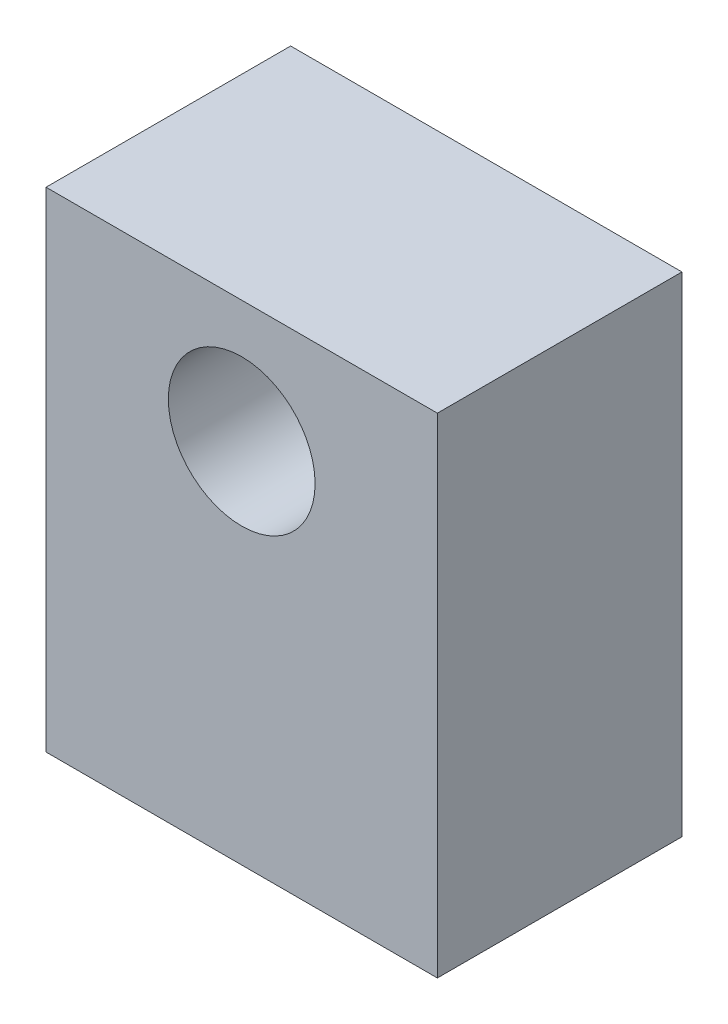
ISO-10303-21;
HEADER;
FILE_DESCRIPTION(('STEP AP214'),'2;1');
FILE_NAME('part.step','',(''),(''),'','','');
FILE_SCHEMA(('AUTOMOTIVE_DESIGN { 1 0 10303 214 1 1 1 1 }'));
ENDSEC;
DATA;
#1=APPLICATION_CONTEXT('core data for automotive mechanical design processes');
#2=APPLICATION_PROTOCOL_DEFINITION('international standard','automotive_design',2000,#1);
#3=PRODUCT_CONTEXT('',#1,'mechanical');
#4=PRODUCT('Part','Part','',(#3));
#5=PRODUCT_RELATED_PRODUCT_CATEGORY('part','',(#4));
#6=PRODUCT_DEFINITION_FORMATION('','',#4);
#7=PRODUCT_DEFINITION_CONTEXT('part definition',#1,'design');
#8=PRODUCT_DEFINITION('design','',#6,#7);
#9=PRODUCT_DEFINITION_SHAPE('','',#8);
#10=(LENGTH_UNIT() NAMED_UNIT(*) SI_UNIT(.MILLI.,.METRE.));
#11=(NAMED_UNIT(*) PLANE_ANGLE_UNIT() SI_UNIT($,.RADIAN.));
#12=(NAMED_UNIT(*) SI_UNIT($,.STERADIAN.) SOLID_ANGLE_UNIT());
#13=UNCERTAINTY_MEASURE_WITH_UNIT(LENGTH_MEASURE(1.E-05),#10,'distance_accuracy_value','');
#14=(GEOMETRIC_REPRESENTATION_CONTEXT(3) GLOBAL_UNCERTAINTY_ASSIGNED_CONTEXT((#13)) GLOBAL_UNIT_ASSIGNED_CONTEXT((#10,
#11,#12)) REPRESENTATION_CONTEXT('',''));
#15=CARTESIAN_POINT('',(0.,0.,0.));
#16=DIRECTION('',(0.,0.,1.));
#17=DIRECTION('',(1.,0.,0.));
#18=AXIS2_PLACEMENT_3D('',#15,#16,#17);
#19=CARTESIAN_POINT('',(0.,0.,5.));
#20=DIRECTION('',(0.,0.,1.));
#21=DIRECTION('',(1.,0.,0.));
#22=AXIS2_PLACEMENT_3D('',#19,#20,#21);
#23=PLANE('',#22);
#24=DIRECTION('',(0.,1.,0.));
#25=VECTOR('',#24,1.);
#26=CARTESIAN_POINT('',(4.,5.,5.));
#27=LINE('',#26,#25);
#28=CARTESIAN_POINT('',(4.,-5.,5.));
#29=VERTEX_POINT('',#28);
#30=CARTESIAN_POINT('',(4.,5.,5.));
#31=VERTEX_POINT('',#30);
#32=EDGE_CURVE('E89',#29,#31,#27,.T.);
#33=ORIENTED_EDGE('',*,*,#32,.T.);
#34=DIRECTION('',(-1.,0.,0.));
#35=VECTOR('',#34,1.);
#36=CARTESIAN_POINT('',(-4.,5.,5.));
#37=LINE('',#36,#35);
#38=CARTESIAN_POINT('',(-4.,5.,5.));
#39=VERTEX_POINT('',#38);
#40=EDGE_CURVE('E84',#31,#39,#37,.T.);
#41=ORIENTED_EDGE('',*,*,#40,.T.);
#42=DIRECTION('',(0.,-1.,0.));
#43=VECTOR('',#42,1.);
#44=CARTESIAN_POINT('',(-4.,5.,5.));
#45=LINE('',#44,#43);
#46=CARTESIAN_POINT('',(-4.,-5.,5.));
#47=VERTEX_POINT('',#46);
#48=EDGE_CURVE('E87',#39,#47,#45,.T.);
#49=ORIENTED_EDGE('',*,*,#48,.T.);
#50=DIRECTION('',(1.,0.,0.));
#51=VECTOR('',#50,1.);
#52=CARTESIAN_POINT('',(-4.,-5.,5.));
#53=LINE('',#52,#51);
#54=EDGE_CURVE('E54',#47,#29,#53,.T.);
#55=ORIENTED_EDGE('',*,*,#54,.T.);
#56=EDGE_LOOP('',(#33,#41,#49,#55));
#57=FACE_BOUND('',#56,.T.);
#58=CARTESIAN_POINT('',(0.,2.5,5.));
#59=DIRECTION('',(0.,0.,1.));
#60=DIRECTION('',(1.,0.,0.));
#61=AXIS2_PLACEMENT_3D('',#58,#59,#60);
#62=CIRCLE('',#61,1.5);
#63=CARTESIAN_POINT('',(1.5,2.5,5.));
#64=VERTEX_POINT('',#63);
#65=EDGE_CURVE('E104',#64,#64,#62,.T.);
#66=ORIENTED_EDGE('',*,*,#65,.F.);
#67=EDGE_LOOP('',(#66));
#68=FACE_BOUND('',#67,.T.);
#69=ADVANCED_FACE('F37',(#57,#68),#23,.T.);
#70=CARTESIAN_POINT('',(0.,0.,0.));
#71=DIRECTION('',(0.,0.,1.));
#72=DIRECTION('',(1.,0.,0.));
#73=AXIS2_PLACEMENT_3D('',#70,#71,#72);
#74=PLANE('',#73);
#75=DIRECTION('',(0.,1.,0.));
#76=VECTOR('',#75,1.);
#77=CARTESIAN_POINT('',(4.,5.,0.));
#78=LINE('',#77,#76);
#79=CARTESIAN_POINT('',(4.,-5.,0.));
#80=VERTEX_POINT('',#79);
#81=CARTESIAN_POINT('',(4.,5.,0.));
#82=VERTEX_POINT('',#81);
#83=EDGE_CURVE('E101',#80,#82,#78,.T.);
#84=ORIENTED_EDGE('',*,*,#83,.F.);
#85=DIRECTION('',(1.,0.,0.));
#86=VECTOR('',#85,1.);
#87=CARTESIAN_POINT('',(-4.,-5.,0.));
#88=LINE('',#87,#86);
#89=CARTESIAN_POINT('',(-4.,-5.,0.));
#90=VERTEX_POINT('',#89);
#91=EDGE_CURVE('E77',#90,#80,#88,.T.);
#92=ORIENTED_EDGE('',*,*,#91,.F.);
#93=DIRECTION('',(0.,-1.,0.));
#94=VECTOR('',#93,1.);
#95=CARTESIAN_POINT('',(-4.,5.,0.));
#96=LINE('',#95,#94);
#97=CARTESIAN_POINT('',(-4.,5.,0.));
#98=VERTEX_POINT('',#97);
#99=EDGE_CURVE('E71',#98,#90,#96,.T.);
#100=ORIENTED_EDGE('',*,*,#99,.F.);
#101=DIRECTION('',(-1.,0.,0.));
#102=VECTOR('',#101,1.);
#103=CARTESIAN_POINT('',(-4.,5.,0.));
#104=LINE('',#103,#102);
#105=EDGE_CURVE('E93',#82,#98,#104,.T.);
#106=ORIENTED_EDGE('',*,*,#105,.F.);
#107=EDGE_LOOP('',(#84,#92,#100,#106));
#108=FACE_BOUND('',#107,.T.);
#109=CARTESIAN_POINT('',(0.,2.5,0.));
#110=DIRECTION('',(0.,0.,1.));
#111=DIRECTION('',(1.,0.,0.));
#112=AXIS2_PLACEMENT_3D('',#109,#110,#111);
#113=CIRCLE('',#112,1.5);
#114=CARTESIAN_POINT('',(1.5,2.5,0.));
#115=VERTEX_POINT('',#114);
#116=EDGE_CURVE('E116',#115,#115,#113,.T.);
#117=ORIENTED_EDGE('',*,*,#116,.T.);
#118=EDGE_LOOP('',(#117));
#119=FACE_BOUND('',#118,.T.);
#120=ADVANCED_FACE('F112',(#108,#119),#74,.F.);
#121=CARTESIAN_POINT('',(4.,5.,5.));
#122=DIRECTION('',(-1.,0.,0.));
#123=DIRECTION('',(0.,-1.,0.));
#124=AXIS2_PLACEMENT_3D('',#121,#122,#123);
#125=PLANE('',#124);
#126=ORIENTED_EDGE('',*,*,#83,.T.);
#127=DIRECTION('',(0.,0.,-1.));
#128=VECTOR('',#127,1.);
#129=CARTESIAN_POINT('',(4.,5.,5.));
#130=LINE('',#129,#128);
#131=EDGE_CURVE('E11',#31,#82,#130,.T.);
#132=ORIENTED_EDGE('',*,*,#131,.F.);
#133=ORIENTED_EDGE('',*,*,#32,.F.);
#134=DIRECTION('',(0.,0.,-1.));
#135=VECTOR('',#134,1.);
#136=CARTESIAN_POINT('',(4.,-5.,5.));
#137=LINE('',#136,#135);
#138=EDGE_CURVE('E97',#29,#80,#137,.T.);
#139=ORIENTED_EDGE('',*,*,#138,.T.);
#140=EDGE_LOOP('',(#126,#132,#133,#139));
#141=FACE_BOUND('',#140,.T.);
#142=ADVANCED_FACE('F39',(#141),#125,.F.);
#143=CARTESIAN_POINT('',(-4.,5.,5.));
#144=DIRECTION('',(0.,-1.,0.));
#145=DIRECTION('',(0.,0.,-1.));
#146=AXIS2_PLACEMENT_3D('',#143,#144,#145);
#147=PLANE('',#146);
#148=ORIENTED_EDGE('',*,*,#105,.T.);
#149=DIRECTION('',(0.,0.,-1.));
#150=VECTOR('',#149,1.);
#151=CARTESIAN_POINT('',(-4.,5.,5.));
#152=LINE('',#151,#150);
#153=EDGE_CURVE('E46',#39,#98,#152,.T.);
#154=ORIENTED_EDGE('',*,*,#153,.F.);
#155=ORIENTED_EDGE('',*,*,#40,.F.);
#156=ORIENTED_EDGE('',*,*,#131,.T.);
#157=EDGE_LOOP('',(#148,#154,#155,#156));
#158=FACE_BOUND('',#157,.T.);
#159=ADVANCED_FACE('F92',(#158),#147,.F.);
#160=CARTESIAN_POINT('',(-4.,5.,5.));
#161=DIRECTION('',(1.,0.,0.));
#162=DIRECTION('',(0.,1.,0.));
#163=AXIS2_PLACEMENT_3D('',#160,#161,#162);
#164=PLANE('',#163);
#165=ORIENTED_EDGE('',*,*,#99,.T.);
#166=DIRECTION('',(0.,0.,-1.));
#167=VECTOR('',#166,1.);
#168=CARTESIAN_POINT('',(-4.,-5.,5.));
#169=LINE('',#168,#167);
#170=EDGE_CURVE('E94',#47,#90,#169,.T.);
#171=ORIENTED_EDGE('',*,*,#170,.F.);
#172=ORIENTED_EDGE('',*,*,#48,.F.);
#173=ORIENTED_EDGE('',*,*,#153,.T.);
#174=EDGE_LOOP('',(#165,#171,#172,#173));
#175=FACE_BOUND('',#174,.T.);
#176=ADVANCED_FACE('F95',(#175),#164,.F.);
#177=CARTESIAN_POINT('',(-4.,-5.,5.));
#178=DIRECTION('',(0.,1.,0.));
#179=DIRECTION('',(0.,0.,1.));
#180=AXIS2_PLACEMENT_3D('',#177,#178,#179);
#181=PLANE('',#180);
#182=ORIENTED_EDGE('',*,*,#91,.T.);
#183=ORIENTED_EDGE('',*,*,#138,.F.);
#184=ORIENTED_EDGE('',*,*,#54,.F.);
#185=ORIENTED_EDGE('',*,*,#170,.T.);
#186=EDGE_LOOP('',(#182,#183,#184,#185));
#187=FACE_BOUND('',#186,.T.);
#188=ADVANCED_FACE('F109',(#187),#181,.F.);
#189=CARTESIAN_POINT('',(0.,2.5,5.));
#190=DIRECTION('',(0.,0.,-1.));
#191=DIRECTION('',(-1.,0.,0.));
#192=AXIS2_PLACEMENT_3D('',#189,#190,#191);
#193=CYLINDRICAL_SURFACE('',#192,1.5);
#194=ORIENTED_EDGE('',*,*,#65,.T.);
#195=EDGE_LOOP('',(#194));
#196=FACE_BOUND('',#195,.T.);
#197=ORIENTED_EDGE('',*,*,#116,.F.);
#198=EDGE_LOOP('',(#197));
#199=FACE_BOUND('',#198,.T.);
#200=ADVANCED_FACE('F122',(#196,#199),#193,.F.);
#201=CLOSED_SHELL('',(#69,#120,#142,#159,#176,#188,#200));
#202=MANIFOLD_SOLID_BREP('B2',#201);
#203=ADVANCED_BREP_SHAPE_REPRESENTATION('',(#18,#202),#14);
#204=SHAPE_DEFINITION_REPRESENTATION(#9,#203);
ENDSEC;
END-ISO-10303-21;
